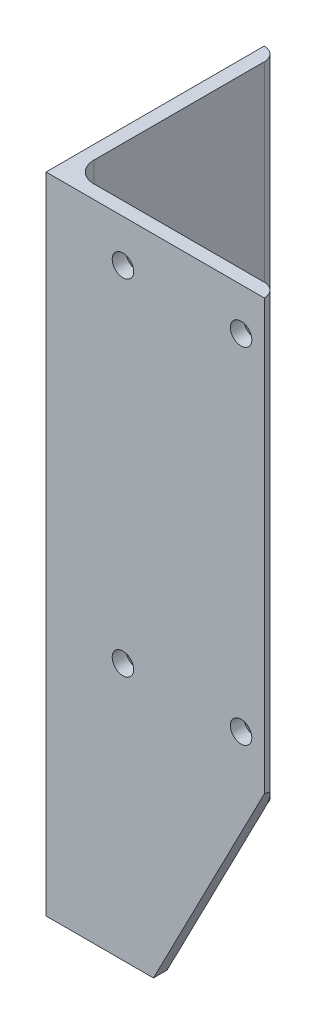
ISO-10303-21;
HEADER;
FILE_DESCRIPTION(('STEP AP214'),'2;1');
FILE_NAME('part.step','',(''),(''),'','','');
FILE_SCHEMA(('AUTOMOTIVE_DESIGN { 1 0 10303 214 1 1 1 1 }'));
ENDSEC;
DATA;
#1=APPLICATION_CONTEXT('core data for automotive mechanical design processes');
#2=APPLICATION_PROTOCOL_DEFINITION('international standard','automotive_design',2000,#1);
#3=PRODUCT_CONTEXT('',#1,'mechanical');
#4=PRODUCT('Part','Part','',(#3));
#5=PRODUCT_RELATED_PRODUCT_CATEGORY('part','',(#4));
#6=PRODUCT_DEFINITION_FORMATION('','',#4);
#7=PRODUCT_DEFINITION_CONTEXT('part definition',#1,'design');
#8=PRODUCT_DEFINITION('design','',#6,#7);
#9=PRODUCT_DEFINITION_SHAPE('','',#8);
#10=(LENGTH_UNIT() NAMED_UNIT(*) SI_UNIT(.MILLI.,.METRE.));
#11=(NAMED_UNIT(*) PLANE_ANGLE_UNIT() SI_UNIT($,.RADIAN.));
#12=(NAMED_UNIT(*) SI_UNIT($,.STERADIAN.) SOLID_ANGLE_UNIT());
#13=UNCERTAINTY_MEASURE_WITH_UNIT(LENGTH_MEASURE(1.E-05),#10,'distance_accuracy_value','');
#14=(GEOMETRIC_REPRESENTATION_CONTEXT(3) GLOBAL_UNCERTAINTY_ASSIGNED_CONTEXT((#13)) GLOBAL_UNIT_ASSIGNED_CONTEXT((#10,
#11,#12)) REPRESENTATION_CONTEXT('',''));
#15=CARTESIAN_POINT('',(0.,0.,0.));
#16=DIRECTION('',(0.,0.,1.));
#17=DIRECTION('',(1.,0.,0.));
#18=AXIS2_PLACEMENT_3D('',#15,#16,#17);
#19=CARTESIAN_POINT('',(50.8,150.,-3.54734504026462E-13));
#20=DIRECTION('',(0.,0.,-1.));
#21=DIRECTION('',(-1.,0.,0.));
#22=AXIS2_PLACEMENT_3D('',#19,#20,#21);
#23=PLANE('',#22);
#24=CARTESIAN_POINT('',(45.4,140.12,0.));
#25=DIRECTION('',(0.,0.,1.));
#26=DIRECTION('',(1.,0.,0.));
#27=AXIS2_PLACEMENT_3D('',#24,#25,#26);
#28=CIRCLE('',#27,2.5);
#29=CARTESIAN_POINT('',(47.9,140.12,0.));
#30=VERTEX_POINT('',#29);
#31=EDGE_CURVE('E310',#30,#30,#28,.T.);
#32=ORIENTED_EDGE('',*,*,#31,.F.);
#33=EDGE_LOOP('',(#32));
#34=FACE_BOUND('',#33,.T.);
#35=CARTESIAN_POINT('',(17.9,59.87,0.));
#36=DIRECTION('',(0.,0.,1.));
#37=DIRECTION('',(1.,0.,0.));
#38=AXIS2_PLACEMENT_3D('',#35,#36,#37);
#39=CIRCLE('',#38,2.5);
#40=CARTESIAN_POINT('',(20.4,59.87,0.));
#41=VERTEX_POINT('',#40);
#42=EDGE_CURVE('E159',#41,#41,#39,.T.);
#43=ORIENTED_EDGE('',*,*,#42,.F.);
#44=EDGE_LOOP('',(#43));
#45=FACE_BOUND('',#44,.T.);
#46=CARTESIAN_POINT('',(45.4,59.87,0.));
#47=DIRECTION('',(0.,0.,1.));
#48=DIRECTION('',(1.,0.,0.));
#49=AXIS2_PLACEMENT_3D('',#46,#47,#48);
#50=CIRCLE('',#49,2.5);
#51=CARTESIAN_POINT('',(47.9,59.87,0.));
#52=VERTEX_POINT('',#51);
#53=EDGE_CURVE('E160',#52,#52,#50,.T.);
#54=ORIENTED_EDGE('',*,*,#53,.F.);
#55=EDGE_LOOP('',(#54));
#56=FACE_BOUND('',#55,.T.);
#57=CARTESIAN_POINT('',(17.9,140.12,0.));
#58=DIRECTION('',(0.,0.,1.));
#59=DIRECTION('',(1.,0.,0.));
#60=AXIS2_PLACEMENT_3D('',#57,#58,#59);
#61=CIRCLE('',#60,2.5);
#62=CARTESIAN_POINT('',(20.4,140.12,0.));
#63=VERTEX_POINT('',#62);
#64=EDGE_CURVE('E319',#63,#63,#61,.T.);
#65=ORIENTED_EDGE('',*,*,#64,.F.);
#66=EDGE_LOOP('',(#65));
#67=FACE_BOUND('',#66,.T.);
#68=DIRECTION('',(1.,0.,0.));
#69=VECTOR('',#68,1.);
#70=CARTESIAN_POINT('',(50.8,0.,-3.54734504026462E-13));
#71=LINE('',#70,#69);
#72=CARTESIAN_POINT('',(0.,0.,0.));
#73=VERTEX_POINT('',#72);
#74=CARTESIAN_POINT('',(25.,0.,-1.74574066942157E-13));
#75=VERTEX_POINT('',#74);
#76=EDGE_CURVE('E198',#73,#75,#71,.T.);
#77=ORIENTED_EDGE('',*,*,#76,.T.);
#78=DIRECTION('',(-0.45855237116426,-0.888667385977248,0.));
#79=VECTOR('',#78,1.);
#80=CARTESIAN_POINT('',(25.,0.,0.));
#81=LINE('',#80,#79);
#82=CARTESIAN_POINT('',(50.8,50.,0.));
#83=VERTEX_POINT('',#82);
#84=EDGE_CURVE('E196',#83,#75,#81,.T.);
#85=ORIENTED_EDGE('',*,*,#84,.F.);
#86=DIRECTION('',(0.,-1.,0.));
#87=VECTOR('',#86,1.);
#88=CARTESIAN_POINT('',(50.8,150.,-3.54734504026462E-13));
#89=LINE('',#88,#87);
#90=CARTESIAN_POINT('',(50.8,150.,-3.54734504026462E-13));
#91=VERTEX_POINT('',#90);
#92=EDGE_CURVE('E77',#91,#83,#89,.T.);
#93=ORIENTED_EDGE('',*,*,#92,.F.);
#94=DIRECTION('',(1.,0.,0.));
#95=VECTOR('',#94,1.);
#96=CARTESIAN_POINT('',(50.8,150.,-3.54734504026462E-13));
#97=LINE('',#96,#95);
#98=CARTESIAN_POINT('',(0.,150.,0.));
#99=VERTEX_POINT('',#98);
#100=EDGE_CURVE('E195',#99,#91,#97,.T.);
#101=ORIENTED_EDGE('',*,*,#100,.F.);
#102=DIRECTION('',(0.,-1.,0.));
#103=VECTOR('',#102,1.);
#104=CARTESIAN_POINT('',(0.,150.,0.));
#105=LINE('',#104,#103);
#106=EDGE_CURVE('E233',#99,#73,#105,.T.);
#107=ORIENTED_EDGE('',*,*,#106,.T.);
#108=EDGE_LOOP('',(#77,#85,#93,#101,#107));
#109=FACE_BOUND('',#108,.T.);
#110=ADVANCED_FACE('F70',(#34,#45,#56,#67,#109),#23,.F.);
#111=CARTESIAN_POINT('',(50.8,150.,-0.00508000000035474));
#112=DIRECTION('',(-1.,0.,0.));
#113=DIRECTION('',(0.,0.,1.));
#114=AXIS2_PLACEMENT_3D('',#111,#112,#113);
#115=PLANE('',#114);
#116=ORIENTED_EDGE('',*,*,#92,.T.);
#117=DIRECTION('',(0.,0.,1.));
#118=VECTOR('',#117,1.);
#119=CARTESIAN_POINT('',(50.8,50.,-10.));
#120=LINE('',#119,#118);
#121=CARTESIAN_POINT('',(50.8,50.,-0.00508000000035494));
#122=VERTEX_POINT('',#121);
#123=EDGE_CURVE('E187',#122,#83,#120,.T.);
#124=ORIENTED_EDGE('',*,*,#123,.F.);
#125=DIRECTION('',(0.,-1.,0.));
#126=VECTOR('',#125,1.);
#127=CARTESIAN_POINT('',(50.8,150.,-0.00508000000035454));
#128=LINE('',#127,#126);
#129=CARTESIAN_POINT('',(50.8,150.,-0.00508000000035454));
#130=VERTEX_POINT('',#129);
#131=EDGE_CURVE('E175',#130,#122,#128,.T.);
#132=ORIENTED_EDGE('',*,*,#131,.F.);
#133=DIRECTION('',(0.,0.,-1.));
#134=VECTOR('',#133,1.);
#135=CARTESIAN_POINT('',(50.8,150.,-0.00508000000035474));
#136=LINE('',#135,#134);
#137=EDGE_CURVE('E188',#91,#130,#136,.T.);
#138=ORIENTED_EDGE('',*,*,#137,.F.);
#139=EDGE_LOOP('',(#116,#124,#132,#138));
#140=FACE_BOUND('',#139,.T.);
#141=ADVANCED_FACE('F185',(#140),#115,.F.);
#142=CARTESIAN_POINT('',(47.63008,150.,-0.00508000000033221));
#143=DIRECTION('',(0.,-1.,0.));
#144=DIRECTION('',(0.,0.,-1.));
#145=AXIS2_PLACEMENT_3D('',#142,#143,#144);
#146=CYLINDRICAL_SURFACE('',#145,3.16992);
#147=DIRECTION('',(0.,-1.,0.));
#148=VECTOR('',#147,1.);
#149=CARTESIAN_POINT('',(47.63008,150.,-3.17500000000033));
#150=LINE('',#149,#148);
#151=CARTESIAN_POINT('',(47.63008,138.990069385493,-3.17500000000033));
#152=VERTEX_POINT('',#151);
#153=CARTESIAN_POINT('',(47.63008,60.999930614507,-3.17500000000033));
#154=VERTEX_POINT('',#153);
#155=EDGE_CURVE('E165',#152,#154,#150,.T.);
#156=ORIENTED_EDGE('',*,*,#155,.F.);
#157=CARTESIAN_POINT('',(47.63008,138.990069385493,-3.17500000000033));
#158=CARTESIAN_POINT('',(47.6618475369519,139.05275257543,-3.17498825386751));
#159=CARTESIAN_POINT('',(47.6909571313549,139.116774798879,-3.17452202136412));
#160=CARTESIAN_POINT('',(47.7436844984121,139.247033056225,-3.17307653014178));
#161=CARTESIAN_POINT('',(47.7673025764054,139.313268966803,-3.17209729995635));
#162=CARTESIAN_POINT('',(47.8088536086666,139.447429812703,-3.1700227159039));
#163=CARTESIAN_POINT('',(47.8267922655728,139.515352979472,-3.16892748000138));
#164=CARTESIAN_POINT('',(47.8568940839173,139.652449445691,-3.16691008522356));
#165=CARTESIAN_POINT('',(47.8690573815136,139.72162271563,-3.16598792226826));
#166=CARTESIAN_POINT('',(47.896745028122,139.930417967276,-3.16382725140149));
#167=CARTESIAN_POINT('',(47.903469075125,140.07132168684,-3.1631944197971));
#168=CARTESIAN_POINT('',(47.8931648052193,140.352117262564,-3.16406673585175));
#169=CARTESIAN_POINT('',(47.8761492563124,140.492009622003,-3.16557073425535));
#170=CARTESIAN_POINT('',(47.825139033339,140.737080556518,-3.16906803220376));
#171=CARTESIAN_POINT('',(47.7956280632721,140.843206777028,-3.17088442589529));
#172=CARTESIAN_POINT('',(47.7411179320655,140.99874356221,-3.17310619479437));
#173=CARTESIAN_POINT('',(47.7212373297196,141.049986880271,-3.17376303397299));
#174=CARTESIAN_POINT('',(47.6781399771871,141.151065997317,-3.17470823686105));
#175=CARTESIAN_POINT('',(47.6549225731832,141.200901518162,-3.17499652824694));
#176=CARTESIAN_POINT('',(47.63008,141.249930614507,-3.17500000000033));
#177=B_SPLINE_CURVE_WITH_KNOTS('',3,(#157,#158,#159,#160,#161,#162,#163,#164,#165,#166,#167,
#168,#169,#170,#171,#172,#173,#174,#175,#176),.UNSPECIFIED.,.F.,.F.,(4,2,2,2,2,2,2,2,2,4),(0.,
0.210745618921371,0.421479517172288,0.632001144014722,0.842517807417935,1.26353161159737,
1.6843190668041,2.01383038404879,2.17862927293929,2.34346049687317),.UNSPECIFIED.);
#178=CARTESIAN_POINT('',(47.63008,141.249930614507,-3.17500000000033));
#179=VERTEX_POINT('',#178);
#180=EDGE_CURVE('E90',#152,#179,#177,.T.);
#181=ORIENTED_EDGE('',*,*,#180,.T.);
#182=CARTESIAN_POINT('',(47.63008,150.,-3.17500000000033));
#183=VERTEX_POINT('',#182);
#184=EDGE_CURVE('E173',#183,#179,#150,.T.);
#185=ORIENTED_EDGE('',*,*,#184,.F.);
#186=CARTESIAN_POINT('',(47.63008,150.,-0.00508000000033221));
#187=DIRECTION('',(0.,1.,0.));
#188=DIRECTION('',(0.,0.,1.));
#189=AXIS2_PLACEMENT_3D('',#186,#187,#188);
#190=CIRCLE('',#189,3.16992);
#191=EDGE_CURVE('E219',#130,#183,#190,.T.);
#192=ORIENTED_EDGE('',*,*,#191,.F.);
#193=ORIENTED_EDGE('',*,*,#131,.T.);
#194=CARTESIAN_POINT('',(47.63008,43.8567441860465,-0.00508000000033221));
#195=DIRECTION('',(-0.888667385977248,0.45855237116426,0.));
#196=DIRECTION('',(-0.45855237116426,-0.888667385977248,0.));
#197=AXIS2_PLACEMENT_3D('',#194,#195,#196);
#198=ELLIPSE('',#197,6.91288541797659,3.16992);
#199=CARTESIAN_POINT('',(47.63008,43.8567441860465,-3.17500000000033));
#200=VERTEX_POINT('',#199);
#201=EDGE_CURVE('E214',#122,#200,#198,.T.);
#202=ORIENTED_EDGE('',*,*,#201,.T.);
#203=CARTESIAN_POINT('',(47.63008,58.740069385493,-3.17500000000033));
#204=VERTEX_POINT('',#203);
#205=EDGE_CURVE('E167',#204,#200,#150,.T.);
#206=ORIENTED_EDGE('',*,*,#205,.F.);
#207=CARTESIAN_POINT('',(47.63008,58.740069385493,-3.17500000000033));
#208=CARTESIAN_POINT('',(47.6618475369519,58.8027525754299,-3.17498825386751));
#209=CARTESIAN_POINT('',(47.6909571313549,58.8667747988787,-3.17452202136412));
#210=CARTESIAN_POINT('',(47.7436844984121,58.9970330562253,-3.17307653014178));
#211=CARTESIAN_POINT('',(47.7673025764054,59.0632689668035,-3.17209729995635));
#212=CARTESIAN_POINT('',(47.8088536086666,59.1974298127035,-3.1700227159039));
#213=CARTESIAN_POINT('',(47.8267922655728,59.2653529794715,-3.16892748000138));
#214=CARTESIAN_POINT('',(47.8568940839173,59.4024494456906,-3.16691008522356));
#215=CARTESIAN_POINT('',(47.8690573815136,59.4716227156296,-3.16598792226826));
#216=CARTESIAN_POINT('',(47.896745028122,59.6804179672758,-3.16382725140148));
#217=CARTESIAN_POINT('',(47.903469075125,59.8213216868398,-3.1631944197971));
#218=CARTESIAN_POINT('',(47.8931648052194,60.102117262564,-3.16406673585175));
#219=CARTESIAN_POINT('',(47.8761492563124,60.2420096220033,-3.16557073425535));
#220=CARTESIAN_POINT('',(47.825139033339,60.4870805565183,-3.16906803220376));
#221=CARTESIAN_POINT('',(47.7956280632721,60.5932067770281,-3.17088442589529));
#222=CARTESIAN_POINT('',(47.7411179320655,60.7487435622101,-3.17310619479437));
#223=CARTESIAN_POINT('',(47.7212373297196,60.7999868802706,-3.17376303397299));
#224=CARTESIAN_POINT('',(47.6781399771871,60.9010659973172,-3.17470823686105));
#225=CARTESIAN_POINT('',(47.6549225731832,60.9509015181625,-3.17499652824694));
#226=CARTESIAN_POINT('',(47.63008,60.999930614507,-3.17500000000033));
#227=B_SPLINE_CURVE_WITH_KNOTS('',3,(#207,#208,#209,#210,#211,#212,#213,#214,#215,#216,#217,
#218,#219,#220,#221,#222,#223,#224,#225,#226),.UNSPECIFIED.,.F.,.F.,(4,2,2,2,2,2,2,2,2,4),(0.,
0.210745618921371,0.421479517172301,0.632001144014743,0.842517807417935,1.26353161159738,
1.68431906680411,2.01383038404878,2.17862927293929,2.34346049687317),.UNSPECIFIED.);
#228=EDGE_CURVE('E83',#204,#154,#227,.T.);
#229=ORIENTED_EDGE('',*,*,#228,.T.);
#230=EDGE_LOOP('',(#156,#181,#185,#192,#193,#202,#206,#229));
#231=FACE_BOUND('',#230,.T.);
#232=ADVANCED_FACE('F164',(#231),#146,.T.);
#233=CARTESIAN_POINT('',(7.93749999999999,150.,-3.17500000000005));
#234=DIRECTION('',(0.,0.,1.));
#235=DIRECTION('',(1.,0.,0.));
#236=AXIS2_PLACEMENT_3D('',#233,#234,#235);
#237=PLANE('',#236);
#238=CARTESIAN_POINT('',(17.9,59.87,-3.17500000000012));
#239=DIRECTION('',(0.,0.,1.));
#240=DIRECTION('',(1.,0.,0.));
#241=AXIS2_PLACEMENT_3D('',#238,#239,#240);
#242=CIRCLE('',#241,2.5);
#243=CARTESIAN_POINT('',(20.4,59.87,-3.17500000000014));
#244=VERTEX_POINT('',#243);
#245=EDGE_CURVE('E326',#244,#244,#242,.F.);
#246=ORIENTED_EDGE('',*,*,#245,.F.);
#247=EDGE_LOOP('',(#246));
#248=FACE_BOUND('',#247,.T.);
#249=CARTESIAN_POINT('',(17.9,140.12,-3.17500000000012));
#250=DIRECTION('',(0.,0.,1.));
#251=DIRECTION('',(1.,0.,0.));
#252=AXIS2_PLACEMENT_3D('',#249,#250,#251);
#253=CIRCLE('',#252,2.5);
#254=CARTESIAN_POINT('',(20.4,140.12,-3.17500000000014));
#255=VERTEX_POINT('',#254);
#256=EDGE_CURVE('E168',#255,#255,#253,.F.);
#257=ORIENTED_EDGE('',*,*,#256,.F.);
#258=EDGE_LOOP('',(#257));
#259=FACE_BOUND('',#258,.T.);
#260=ORIENTED_EDGE('',*,*,#184,.T.);
#261=CARTESIAN_POINT('',(45.4,140.12,-3.17500000000031));
#262=DIRECTION('',(0.,0.,1.));
#263=DIRECTION('',(1.,0.,0.));
#264=AXIS2_PLACEMENT_3D('',#261,#262,#263);
#265=CIRCLE('',#264,2.5);
#266=EDGE_CURVE('E172',#152,#179,#265,.F.);
#267=ORIENTED_EDGE('',*,*,#266,.F.);
#268=ORIENTED_EDGE('',*,*,#155,.T.);
#269=CARTESIAN_POINT('',(45.4,59.87,-3.17500000000031));
#270=DIRECTION('',(0.,0.,1.));
#271=DIRECTION('',(1.,0.,0.));
#272=AXIS2_PLACEMENT_3D('',#269,#270,#271);
#273=CIRCLE('',#272,2.5);
#274=EDGE_CURVE('E154',#204,#154,#273,.F.);
#275=ORIENTED_EDGE('',*,*,#274,.F.);
#276=ORIENTED_EDGE('',*,*,#205,.T.);
#277=DIRECTION('',(-0.45855237116426,-0.888667385977248,0.));
#278=VECTOR('',#277,1.);
#279=CARTESIAN_POINT('',(82.5373439494067,111.506480522106,-3.17500000000058));
#280=LINE('',#279,#278);
#281=CARTESIAN_POINT('',(25.,0.,-3.17500000000019));
#282=VERTEX_POINT('',#281);
#283=EDGE_CURVE('E202',#200,#282,#280,.T.);
#284=ORIENTED_EDGE('',*,*,#283,.T.);
#285=DIRECTION('',(-1.,0.,0.));
#286=VECTOR('',#285,1.);
#287=CARTESIAN_POINT('',(7.93749999999999,0.,-3.17500000000005));
#288=LINE('',#287,#286);
#289=CARTESIAN_POINT('',(7.93749999999999,0.,-3.17500000000005));
#290=VERTEX_POINT('',#289);
#291=EDGE_CURVE('E235',#282,#290,#288,.T.);
#292=ORIENTED_EDGE('',*,*,#291,.T.);
#293=DIRECTION('',(0.,-1.,0.));
#294=VECTOR('',#293,1.);
#295=CARTESIAN_POINT('',(7.93749999999999,150.,-3.17500000000005));
#296=LINE('',#295,#294);
#297=CARTESIAN_POINT('',(7.93749999999999,150.,-3.17500000000005));
#298=VERTEX_POINT('',#297);
#299=EDGE_CURVE('E176',#298,#290,#296,.T.);
#300=ORIENTED_EDGE('',*,*,#299,.F.);
#301=DIRECTION('',(-1.,0.,0.));
#302=VECTOR('',#301,1.);
#303=CARTESIAN_POINT('',(7.93749999999999,150.,-3.17500000000005));
#304=LINE('',#303,#302);
#305=EDGE_CURVE('E221',#183,#298,#304,.T.);
#306=ORIENTED_EDGE('',*,*,#305,.F.);
#307=EDGE_LOOP('',(#260,#267,#268,#275,#276,#284,#292,#300,#306));
#308=FACE_BOUND('',#307,.T.);
#309=ADVANCED_FACE('F171',(#248,#259,#308),#237,.F.);
#310=CARTESIAN_POINT('',(7.93749999999996,150.,-7.93750000000005));
#311=DIRECTION('',(0.,-1.,0.));
#312=DIRECTION('',(0.,0.,-1.));
#313=AXIS2_PLACEMENT_3D('',#310,#311,#312);
#314=CYLINDRICAL_SURFACE('',#313,4.7625);
#315=CARTESIAN_POINT('',(7.93749999999996,0.,-7.93750000000005));
#316=DIRECTION('',(0.,-1.,0.));
#317=DIRECTION('',(0.,0.,-1.));
#318=AXIS2_PLACEMENT_3D('',#315,#316,#317);
#319=CIRCLE('',#318,4.7625);
#320=CARTESIAN_POINT('',(3.17499999999996,0.,-7.93750000000002));
#321=VERTEX_POINT('',#320);
#322=EDGE_CURVE('E237',#290,#321,#319,.T.);
#323=ORIENTED_EDGE('',*,*,#322,.T.);
#324=DIRECTION('',(0.,-1.,0.));
#325=VECTOR('',#324,1.);
#326=CARTESIAN_POINT('',(3.17499999999996,150.,-7.93750000000002));
#327=LINE('',#326,#325);
#328=CARTESIAN_POINT('',(3.17499999999996,150.,-7.93750000000002));
#329=VERTEX_POINT('',#328);
#330=EDGE_CURVE('E255',#329,#321,#327,.T.);
#331=ORIENTED_EDGE('',*,*,#330,.F.);
#332=CARTESIAN_POINT('',(7.93749999999996,150.,-7.93750000000005));
#333=DIRECTION('',(0.,-1.,0.));
#334=DIRECTION('',(0.,0.,-1.));
#335=AXIS2_PLACEMENT_3D('',#332,#333,#334);
#336=CIRCLE('',#335,4.7625);
#337=EDGE_CURVE('E223',#298,#329,#336,.T.);
#338=ORIENTED_EDGE('',*,*,#337,.F.);
#339=ORIENTED_EDGE('',*,*,#299,.T.);
#340=EDGE_LOOP('',(#323,#331,#338,#339));
#341=FACE_BOUND('',#340,.T.);
#342=ADVANCED_FACE('F266',(#341),#314,.F.);
#343=CARTESIAN_POINT('',(3.17499999999967,150.,-47.63008));
#344=DIRECTION('',(-1.,0.,0.));
#345=DIRECTION('',(0.,0.,1.));
#346=AXIS2_PLACEMENT_3D('',#343,#344,#345);
#347=PLANE('',#346);
#348=DIRECTION('',(0.,0.,-1.));
#349=VECTOR('',#348,1.);
#350=CARTESIAN_POINT('',(3.17499999999967,0.,-47.63008));
#351=LINE('',#350,#349);
#352=CARTESIAN_POINT('',(3.17499999999966,0.,-47.63008));
#353=VERTEX_POINT('',#352);
#354=EDGE_CURVE('E239',#321,#353,#351,.T.);
#355=ORIENTED_EDGE('',*,*,#354,.T.);
#356=DIRECTION('',(0.,-1.,0.));
#357=VECTOR('',#356,1.);
#358=CARTESIAN_POINT('',(3.17499999999966,150.,-47.63008));
#359=LINE('',#358,#357);
#360=CARTESIAN_POINT('',(3.17499999999966,150.,-47.63008));
#361=VERTEX_POINT('',#360);
#362=EDGE_CURVE('E253',#361,#353,#359,.T.);
#363=ORIENTED_EDGE('',*,*,#362,.F.);
#364=DIRECTION('',(0.,0.,-1.));
#365=VECTOR('',#364,1.);
#366=CARTESIAN_POINT('',(3.17499999999967,150.,-47.63008));
#367=LINE('',#366,#365);
#368=EDGE_CURVE('E225',#329,#361,#367,.T.);
#369=ORIENTED_EDGE('',*,*,#368,.F.);
#370=ORIENTED_EDGE('',*,*,#330,.T.);
#371=EDGE_LOOP('',(#355,#363,#369,#370));
#372=FACE_BOUND('',#371,.T.);
#373=ADVANCED_FACE('F274',(#372),#347,.F.);
#374=CARTESIAN_POINT('',(0.0050799999996676,150.,-47.63008));
#375=DIRECTION('',(0.,-1.,0.));
#376=DIRECTION('',(0.,0.,-1.));
#377=AXIS2_PLACEMENT_3D('',#374,#375,#376);
#378=CYLINDRICAL_SURFACE('',#377,3.16992);
#379=CARTESIAN_POINT('',(0.0050799999996676,0.,-47.63008));
#380=DIRECTION('',(0.,1.,0.));
#381=DIRECTION('',(0.,0.,-1.));
#382=AXIS2_PLACEMENT_3D('',#379,#380,#381);
#383=CIRCLE('',#382,3.16992);
#384=CARTESIAN_POINT('',(0.00507999999964527,0.,-50.8));
#385=VERTEX_POINT('',#384);
#386=EDGE_CURVE('E241',#353,#385,#383,.T.);
#387=ORIENTED_EDGE('',*,*,#386,.T.);
#388=DIRECTION('',(0.,-1.,0.));
#389=VECTOR('',#388,1.);
#390=CARTESIAN_POINT('',(0.00507999999964527,150.,-50.8));
#391=LINE('',#390,#389);
#392=CARTESIAN_POINT('',(0.00507999999964527,150.,-50.8));
#393=VERTEX_POINT('',#392);
#394=EDGE_CURVE('E250',#393,#385,#391,.T.);
#395=ORIENTED_EDGE('',*,*,#394,.F.);
#396=CARTESIAN_POINT('',(0.0050799999996676,150.,-47.63008));
#397=DIRECTION('',(0.,1.,0.));
#398=DIRECTION('',(0.,0.,-1.));
#399=AXIS2_PLACEMENT_3D('',#396,#397,#398);
#400=CIRCLE('',#399,3.16992);
#401=EDGE_CURVE('E227',#361,#393,#400,.T.);
#402=ORIENTED_EDGE('',*,*,#401,.F.);
#403=ORIENTED_EDGE('',*,*,#362,.T.);
#404=EDGE_LOOP('',(#387,#395,#402,#403));
#405=FACE_BOUND('',#404,.T.);
#406=ADVANCED_FACE('F277',(#405),#378,.T.);
#407=CARTESIAN_POINT('',(-3.54734504026462E-13,150.,-50.8));
#408=DIRECTION('',(0.,0.,1.));
#409=DIRECTION('',(1.,0.,0.));
#410=AXIS2_PLACEMENT_3D('',#407,#408,#409);
#411=PLANE('',#410);
#412=DIRECTION('',(-1.,0.,0.));
#413=VECTOR('',#412,1.);
#414=CARTESIAN_POINT('',(-3.54734504026462E-13,0.,-50.8));
#415=LINE('',#414,#413);
#416=CARTESIAN_POINT('',(-3.54734504026462E-13,0.,-50.8));
#417=VERTEX_POINT('',#416);
#418=EDGE_CURVE('E243',#385,#417,#415,.T.);
#419=ORIENTED_EDGE('',*,*,#418,.T.);
#420=DIRECTION('',(0.,-1.,0.));
#421=VECTOR('',#420,1.);
#422=CARTESIAN_POINT('',(-3.54734504026462E-13,150.,-50.8));
#423=LINE('',#422,#421);
#424=CARTESIAN_POINT('',(-3.54734504026462E-13,150.,-50.8));
#425=VERTEX_POINT('',#424);
#426=EDGE_CURVE('E247',#425,#417,#423,.T.);
#427=ORIENTED_EDGE('',*,*,#426,.F.);
#428=DIRECTION('',(-1.,0.,0.));
#429=VECTOR('',#428,1.);
#430=CARTESIAN_POINT('',(-3.54734504026462E-13,150.,-50.8));
#431=LINE('',#430,#429);
#432=EDGE_CURVE('E229',#393,#425,#431,.T.);
#433=ORIENTED_EDGE('',*,*,#432,.F.);
#434=ORIENTED_EDGE('',*,*,#394,.T.);
#435=EDGE_LOOP('',(#419,#427,#433,#434));
#436=FACE_BOUND('',#435,.T.);
#437=ADVANCED_FACE('F293',(#436),#411,.F.);
#438=CARTESIAN_POINT('',(0.,150.,0.));
#439=DIRECTION('',(1.,0.,0.));
#440=DIRECTION('',(0.,0.,-1.));
#441=AXIS2_PLACEMENT_3D('',#438,#439,#440);
#442=PLANE('',#441);
#443=DIRECTION('',(0.,0.,1.));
#444=VECTOR('',#443,1.);
#445=CARTESIAN_POINT('',(0.,0.,0.));
#446=LINE('',#445,#444);
#447=EDGE_CURVE('E217',#417,#73,#446,.T.);
#448=ORIENTED_EDGE('',*,*,#447,.T.);
#449=ORIENTED_EDGE('',*,*,#106,.F.);
#450=DIRECTION('',(0.,0.,1.));
#451=VECTOR('',#450,1.);
#452=CARTESIAN_POINT('',(0.,150.,0.));
#453=LINE('',#452,#451);
#454=EDGE_CURVE('E231',#425,#99,#453,.T.);
#455=ORIENTED_EDGE('',*,*,#454,.F.);
#456=ORIENTED_EDGE('',*,*,#426,.T.);
#457=EDGE_LOOP('',(#448,#449,#455,#456));
#458=FACE_BOUND('',#457,.T.);
#459=ADVANCED_FACE('F290',(#458),#442,.F.);
#460=CARTESIAN_POINT('',(0.0050799999996676,150.,-47.63008));
#461=DIRECTION('',(0.,-1.,0.));
#462=DIRECTION('',(0.,0.,-1.));
#463=AXIS2_PLACEMENT_3D('',#460,#461,#462);
#464=PLANE('',#463);
#465=ORIENTED_EDGE('',*,*,#100,.T.);
#466=ORIENTED_EDGE('',*,*,#137,.T.);
#467=ORIENTED_EDGE('',*,*,#191,.T.);
#468=ORIENTED_EDGE('',*,*,#305,.T.);
#469=ORIENTED_EDGE('',*,*,#337,.T.);
#470=ORIENTED_EDGE('',*,*,#368,.T.);
#471=ORIENTED_EDGE('',*,*,#401,.T.);
#472=ORIENTED_EDGE('',*,*,#432,.T.);
#473=ORIENTED_EDGE('',*,*,#454,.T.);
#474=EDGE_LOOP('',(#465,#466,#467,#468,#469,#470,#471,#472,#473));
#475=FACE_BOUND('',#474,.T.);
#476=ADVANCED_FACE('F281',(#475),#464,.F.);
#477=CARTESIAN_POINT('',(0.0050799999996676,0.,-47.63008));
#478=DIRECTION('',(0.,-1.,0.));
#479=DIRECTION('',(0.,0.,-1.));
#480=AXIS2_PLACEMENT_3D('',#477,#478,#479);
#481=PLANE('',#480);
#482=DIRECTION('',(0.,0.,-1.));
#483=VECTOR('',#482,1.);
#484=CARTESIAN_POINT('',(25.,0.,-47.63008));
#485=LINE('',#484,#483);
#486=EDGE_CURVE('E13',#75,#282,#485,.T.);
#487=ORIENTED_EDGE('',*,*,#486,.F.);
#488=ORIENTED_EDGE('',*,*,#76,.F.);
#489=ORIENTED_EDGE('',*,*,#447,.F.);
#490=ORIENTED_EDGE('',*,*,#418,.F.);
#491=ORIENTED_EDGE('',*,*,#386,.F.);
#492=ORIENTED_EDGE('',*,*,#354,.F.);
#493=ORIENTED_EDGE('',*,*,#322,.F.);
#494=ORIENTED_EDGE('',*,*,#291,.F.);
#495=EDGE_LOOP('',(#487,#488,#489,#490,#491,#492,#493,#494));
#496=FACE_BOUND('',#495,.T.);
#497=ADVANCED_FACE('F270',(#496),#481,.T.);
#498=CARTESIAN_POINT('',(25.,0.,-10.));
#499=DIRECTION('',(-0.888667385977248,0.45855237116426,0.));
#500=DIRECTION('',(-0.45855237116426,-0.888667385977248,0.));
#501=AXIS2_PLACEMENT_3D('',#498,#499,#500);
#502=PLANE('',#501);
#503=ORIENTED_EDGE('',*,*,#123,.T.);
#504=ORIENTED_EDGE('',*,*,#84,.T.);
#505=ORIENTED_EDGE('',*,*,#486,.T.);
#506=ORIENTED_EDGE('',*,*,#283,.F.);
#507=ORIENTED_EDGE('',*,*,#201,.F.);
#508=EDGE_LOOP('',(#503,#504,#505,#506,#507));
#509=FACE_BOUND('',#508,.T.);
#510=ADVANCED_FACE('F286',(#509),#502,.F.);
#511=CARTESIAN_POINT('',(17.9,140.12,-10.2460678118658));
#512=DIRECTION('',(0.,0.,1.));
#513=DIRECTION('',(1.,0.,0.));
#514=AXIS2_PLACEMENT_3D('',#511,#512,#513);
#515=CYLINDRICAL_SURFACE('',#514,2.5);
#516=ORIENTED_EDGE('',*,*,#256,.T.);
#517=EDGE_LOOP('',(#516));
#518=FACE_BOUND('',#517,.T.);
#519=ORIENTED_EDGE('',*,*,#64,.T.);
#520=EDGE_LOOP('',(#519));
#521=FACE_BOUND('',#520,.T.);
#522=ADVANCED_FACE('F338',(#518,#521),#515,.F.);
#523=CARTESIAN_POINT('',(45.4,59.87,-10.2460678118658));
#524=DIRECTION('',(0.,0.,1.));
#525=DIRECTION('',(1.,0.,0.));
#526=AXIS2_PLACEMENT_3D('',#523,#524,#525);
#527=CYLINDRICAL_SURFACE('',#526,2.5);
#528=ORIENTED_EDGE('',*,*,#53,.T.);
#529=EDGE_LOOP('',(#528));
#530=FACE_BOUND('',#529,.T.);
#531=ORIENTED_EDGE('',*,*,#274,.T.);
#532=ORIENTED_EDGE('',*,*,#228,.F.);
#533=EDGE_LOOP('',(#531,#532));
#534=FACE_BOUND('',#533,.T.);
#535=ADVANCED_FACE('F155',(#530,#534),#527,.F.);
#536=CARTESIAN_POINT('',(17.9,59.87,-10.2460678118658));
#537=DIRECTION('',(0.,0.,1.));
#538=DIRECTION('',(1.,0.,0.));
#539=AXIS2_PLACEMENT_3D('',#536,#537,#538);
#540=CYLINDRICAL_SURFACE('',#539,2.5);
#541=ORIENTED_EDGE('',*,*,#245,.T.);
#542=EDGE_LOOP('',(#541));
#543=FACE_BOUND('',#542,.T.);
#544=ORIENTED_EDGE('',*,*,#42,.T.);
#545=EDGE_LOOP('',(#544));
#546=FACE_BOUND('',#545,.T.);
#547=ADVANCED_FACE('F337',(#543,#546),#540,.F.);
#548=CARTESIAN_POINT('',(45.4,140.12,-10.2460678118658));
#549=DIRECTION('',(0.,0.,1.));
#550=DIRECTION('',(1.,0.,0.));
#551=AXIS2_PLACEMENT_3D('',#548,#549,#550);
#552=CYLINDRICAL_SURFACE('',#551,2.5);
#553=ORIENTED_EDGE('',*,*,#31,.T.);
#554=EDGE_LOOP('',(#553));
#555=FACE_BOUND('',#554,.T.);
#556=ORIENTED_EDGE('',*,*,#266,.T.);
#557=ORIENTED_EDGE('',*,*,#180,.F.);
#558=EDGE_LOOP('',(#556,#557));
#559=FACE_BOUND('',#558,.T.);
#560=ADVANCED_FACE('F340',(#555,#559),#552,.F.);
#561=CLOSED_SHELL('',(#110,#141,#232,#309,#342,#373,#406,#437,#459,#476,#497,#510,#522,#535,
#547,#560));
#562=MANIFOLD_SOLID_BREP('B2',#561);
#563=ADVANCED_BREP_SHAPE_REPRESENTATION('',(#18,#562),#14);
#564=SHAPE_DEFINITION_REPRESENTATION(#9,#563);
ENDSEC;
END-ISO-10303-21;
